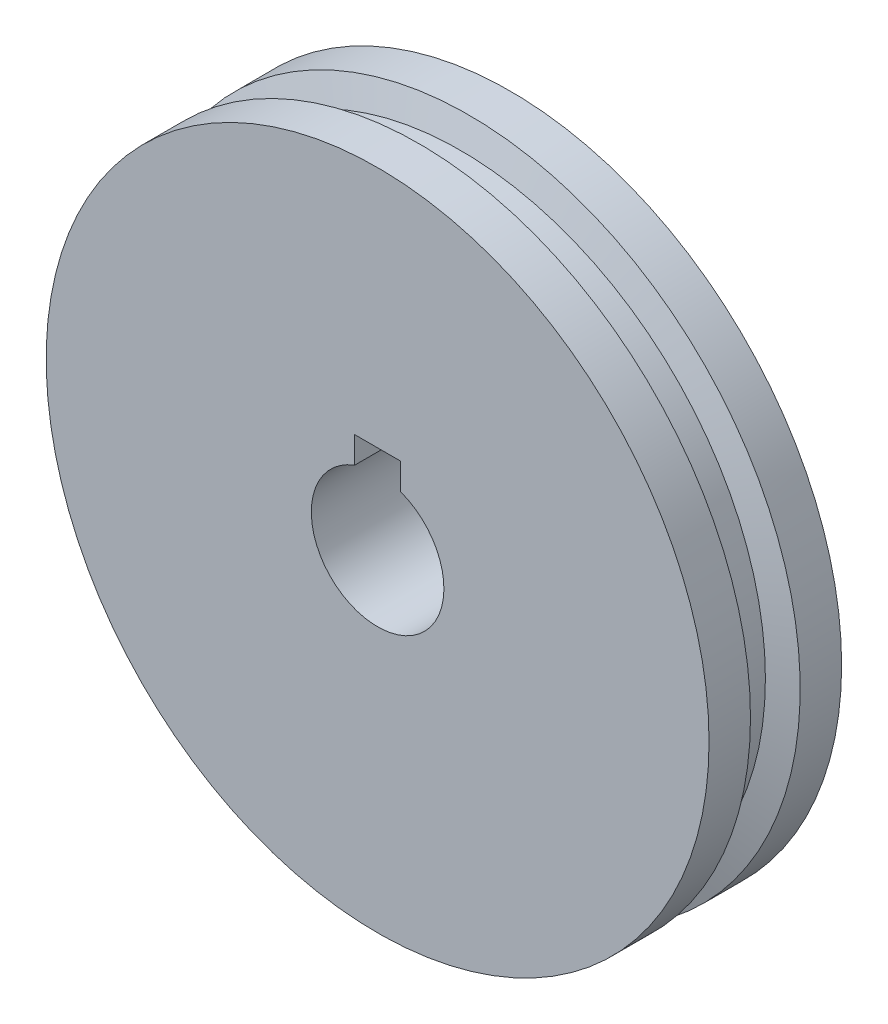
ISO-10303-21;
HEADER;
FILE_DESCRIPTION(('STEP AP214'),'2;1');
FILE_NAME('part.step','',(''),(''),'','','');
FILE_SCHEMA(('AUTOMOTIVE_DESIGN { 1 0 10303 214 1 1 1 1 }'));
ENDSEC;
DATA;
#1=APPLICATION_CONTEXT('core data for automotive mechanical design processes');
#2=APPLICATION_PROTOCOL_DEFINITION('international standard','automotive_design',2000,#1);
#3=PRODUCT_CONTEXT('',#1,'mechanical');
#4=PRODUCT('Part','Part','',(#3));
#5=PRODUCT_RELATED_PRODUCT_CATEGORY('part','',(#4));
#6=PRODUCT_DEFINITION_FORMATION('','',#4);
#7=PRODUCT_DEFINITION_CONTEXT('part definition',#1,'design');
#8=PRODUCT_DEFINITION('design','',#6,#7);
#9=PRODUCT_DEFINITION_SHAPE('','',#8);
#10=(LENGTH_UNIT() NAMED_UNIT(*) SI_UNIT(.MILLI.,.METRE.));
#11=(NAMED_UNIT(*) PLANE_ANGLE_UNIT() SI_UNIT($,.RADIAN.));
#12=(NAMED_UNIT(*) SI_UNIT($,.STERADIAN.) SOLID_ANGLE_UNIT());
#13=UNCERTAINTY_MEASURE_WITH_UNIT(LENGTH_MEASURE(1.E-05),#10,'distance_accuracy_value','');
#14=(GEOMETRIC_REPRESENTATION_CONTEXT(3) GLOBAL_UNCERTAINTY_ASSIGNED_CONTEXT((#13)) GLOBAL_UNIT_ASSIGNED_CONTEXT((#10,
#11,#12)) REPRESENTATION_CONTEXT('',''));
#15=CARTESIAN_POINT('',(0.,0.,0.));
#16=DIRECTION('',(0.,0.,1.));
#17=DIRECTION('',(1.,0.,0.));
#18=AXIS2_PLACEMENT_3D('',#15,#16,#17);
#19=CARTESIAN_POINT('',(0.,0.,5.));
#20=DIRECTION('',(0.,0.,-1.));
#21=DIRECTION('',(-1.,0.,0.));
#22=AXIS2_PLACEMENT_3D('',#19,#20,#21);
#23=CYLINDRICAL_SURFACE('',#22,25.);
#24=CARTESIAN_POINT('',(0.,0.,5.));
#25=DIRECTION('',(0.,0.,1.));
#26=DIRECTION('',(1.,0.,0.));
#27=AXIS2_PLACEMENT_3D('',#24,#25,#26);
#28=CIRCLE('',#27,25.);
#29=CARTESIAN_POINT('',(25.,0.,5.));
#30=VERTEX_POINT('',#29);
#31=EDGE_CURVE('E13',#30,#30,#28,.T.);
#32=ORIENTED_EDGE('',*,*,#31,.F.);
#33=EDGE_LOOP('',(#32));
#34=FACE_BOUND('',#33,.T.);
#35=CARTESIAN_POINT('',(0.,0.,1.875));
#36=DIRECTION('',(0.,0.,1.));
#37=DIRECTION('',(1.,0.,0.));
#38=AXIS2_PLACEMENT_3D('',#35,#36,#37);
#39=CIRCLE('',#38,25.);
#40=CARTESIAN_POINT('',(25.,0.,1.875));
#41=VERTEX_POINT('',#40);
#42=EDGE_CURVE('E49',#41,#41,#39,.F.);
#43=ORIENTED_EDGE('',*,*,#42,.F.);
#44=EDGE_LOOP('',(#43));
#45=FACE_BOUND('',#44,.T.);
#46=ADVANCED_FACE('F46',(#34,#45),#23,.T.);
#47=CARTESIAN_POINT('',(0.,0.,-5.));
#48=DIRECTION('',(0.,0.,1.));
#49=DIRECTION('',(1.,0.,0.));
#50=AXIS2_PLACEMENT_3D('',#47,#48,#49);
#51=CIRCLE('',#50,25.);
#52=CARTESIAN_POINT('',(25.,0.,-5.));
#53=VERTEX_POINT('',#52);
#54=EDGE_CURVE('E54',#53,#53,#51,.T.);
#55=ORIENTED_EDGE('',*,*,#54,.T.);
#56=EDGE_LOOP('',(#55));
#57=FACE_BOUND('',#56,.T.);
#58=CARTESIAN_POINT('',(0.,0.,-1.875));
#59=DIRECTION('',(0.,0.,-1.));
#60=DIRECTION('',(-1.,0.,0.));
#61=AXIS2_PLACEMENT_3D('',#58,#59,#60);
#62=CIRCLE('',#61,25.);
#63=CARTESIAN_POINT('',(-25.,0.,-1.875));
#64=VERTEX_POINT('',#63);
#65=EDGE_CURVE('E126',#64,#64,#62,.F.);
#66=ORIENTED_EDGE('',*,*,#65,.F.);
#67=EDGE_LOOP('',(#66));
#68=FACE_BOUND('',#67,.T.);
#69=ADVANCED_FACE('F142',(#57,#68),#23,.T.);
#70=CARTESIAN_POINT('',(0.,0.,5.));
#71=DIRECTION('',(0.,0.,1.));
#72=DIRECTION('',(1.,0.,0.));
#73=AXIS2_PLACEMENT_3D('',#70,#71,#72);
#74=PLANE('',#73);
#75=DIRECTION('',(0.,1.,0.));
#76=VECTOR('',#75,1.);
#77=CARTESIAN_POINT('',(-1.73287898578607,6.69010985165817,5.));
#78=LINE('',#77,#76);
#79=CARTESIAN_POINT('',(-1.73287898578607,4.69010985165817,5.));
#80=VERTEX_POINT('',#79);
#81=CARTESIAN_POINT('',(-1.73287898578607,6.69010985165817,5.));
#82=VERTEX_POINT('',#81);
#83=EDGE_CURVE('E71',#80,#82,#78,.T.);
#84=ORIENTED_EDGE('',*,*,#83,.T.);
#85=DIRECTION('',(1.,0.,0.));
#86=VECTOR('',#85,1.);
#87=CARTESIAN_POINT('',(1.73287898578607,6.69010985165817,5.));
#88=LINE('',#87,#86);
#89=CARTESIAN_POINT('',(1.73287898578607,6.69010985165817,5.));
#90=VERTEX_POINT('',#89);
#91=EDGE_CURVE('E96',#82,#90,#88,.T.);
#92=ORIENTED_EDGE('',*,*,#91,.T.);
#93=DIRECTION('',(0.,-1.,0.));
#94=VECTOR('',#93,1.);
#95=CARTESIAN_POINT('',(1.73287898578607,6.69010985165817,5.));
#96=LINE('',#95,#94);
#97=CARTESIAN_POINT('',(1.73287898578607,4.69010985165817,5.));
#98=VERTEX_POINT('',#97);
#99=EDGE_CURVE('E102',#90,#98,#96,.T.);
#100=ORIENTED_EDGE('',*,*,#99,.T.);
#101=CARTESIAN_POINT('',(0.,0.,5.));
#102=DIRECTION('',(0.,0.,1.));
#103=DIRECTION('',(1.,0.,0.));
#104=AXIS2_PLACEMENT_3D('',#101,#102,#103);
#105=CIRCLE('',#104,5.);
#106=EDGE_CURVE('E127',#80,#98,#105,.T.);
#107=ORIENTED_EDGE('',*,*,#106,.F.);
#108=EDGE_LOOP('',(#84,#92,#100,#107));
#109=FACE_BOUND('',#108,.T.);
#110=ORIENTED_EDGE('',*,*,#31,.T.);
#111=EDGE_LOOP('',(#110));
#112=FACE_BOUND('',#111,.T.);
#113=ADVANCED_FACE('F108',(#109,#112),#74,.T.);
#114=CARTESIAN_POINT('',(0.,0.,-5.));
#115=DIRECTION('',(0.,0.,1.));
#116=DIRECTION('',(1.,0.,0.));
#117=AXIS2_PLACEMENT_3D('',#114,#115,#116);
#118=PLANE('',#117);
#119=ORIENTED_EDGE('',*,*,#54,.F.);
#120=EDGE_LOOP('',(#119));
#121=FACE_BOUND('',#120,.T.);
#122=DIRECTION('',(1.,0.,0.));
#123=VECTOR('',#122,1.);
#124=CARTESIAN_POINT('',(1.73287898578607,6.69010985165817,-5.));
#125=LINE('',#124,#123);
#126=CARTESIAN_POINT('',(-1.73287898578607,6.69010985165817,-5.));
#127=VERTEX_POINT('',#126);
#128=CARTESIAN_POINT('',(1.73287898578607,6.69010985165817,-5.));
#129=VERTEX_POINT('',#128);
#130=EDGE_CURVE('E98',#127,#129,#125,.T.);
#131=ORIENTED_EDGE('',*,*,#130,.F.);
#132=DIRECTION('',(0.,1.,0.));
#133=VECTOR('',#132,1.);
#134=CARTESIAN_POINT('',(-1.73287898578607,6.69010985165817,-5.));
#135=LINE('',#134,#133);
#136=CARTESIAN_POINT('',(-1.73287898578607,4.69010985165817,-5.));
#137=VERTEX_POINT('',#136);
#138=EDGE_CURVE('E113',#137,#127,#135,.T.);
#139=ORIENTED_EDGE('',*,*,#138,.F.);
#140=CARTESIAN_POINT('',(0.,0.,-5.));
#141=DIRECTION('',(0.,0.,1.));
#142=DIRECTION('',(1.,0.,0.));
#143=AXIS2_PLACEMENT_3D('',#140,#141,#142);
#144=CIRCLE('',#143,5.);
#145=CARTESIAN_POINT('',(1.73287898578607,4.69010985165817,-5.));
#146=VERTEX_POINT('',#145);
#147=EDGE_CURVE('E129',#137,#146,#144,.T.);
#148=ORIENTED_EDGE('',*,*,#147,.T.);
#149=DIRECTION('',(0.,-1.,0.));
#150=VECTOR('',#149,1.);
#151=CARTESIAN_POINT('',(1.73287898578607,6.69010985165817,-5.));
#152=LINE('',#151,#150);
#153=EDGE_CURVE('E62',#129,#146,#152,.T.);
#154=ORIENTED_EDGE('',*,*,#153,.F.);
#155=EDGE_LOOP('',(#131,#139,#148,#154));
#156=FACE_BOUND('',#155,.T.);
#157=ADVANCED_FACE('F150',(#121,#156),#118,.F.);
#158=CARTESIAN_POINT('',(0.,0.,5.));
#159=DIRECTION('',(0.,0.,-1.));
#160=DIRECTION('',(-1.,0.,0.));
#161=AXIS2_PLACEMENT_3D('',#158,#159,#160);
#162=CYLINDRICAL_SURFACE('',#161,5.);
#163=DIRECTION('',(0.,0.,-1.));
#164=VECTOR('',#163,1.);
#165=CARTESIAN_POINT('',(-1.73287898578607,4.69010985165817,5.));
#166=LINE('',#165,#164);
#167=EDGE_CURVE('E84',#80,#137,#166,.T.);
#168=ORIENTED_EDGE('',*,*,#167,.F.);
#169=ORIENTED_EDGE('',*,*,#106,.T.);
#170=DIRECTION('',(0.,0.,-1.));
#171=VECTOR('',#170,1.);
#172=CARTESIAN_POINT('',(1.73287898578607,4.69010985165817,5.));
#173=LINE('',#172,#171);
#174=EDGE_CURVE('E99',#98,#146,#173,.T.);
#175=ORIENTED_EDGE('',*,*,#174,.T.);
#176=ORIENTED_EDGE('',*,*,#147,.F.);
#177=EDGE_LOOP('',(#168,#169,#175,#176));
#178=FACE_BOUND('',#177,.T.);
#179=ADVANCED_FACE('F155',(#178),#162,.F.);
#180=CARTESIAN_POINT('',(0.,0.,2.5));
#181=DIRECTION('',(0.,0.,1.));
#182=DIRECTION('',(1.,0.,0.));
#183=AXIS2_PLACEMENT_3D('',#180,#181,#182);
#184=CONICAL_SURFACE('',#183,27.,1.26791145841992);
#185=CARTESIAN_POINT('',(0.,0.,1.25));
#186=DIRECTION('',(0.,0.,1.));
#187=DIRECTION('',(1.,0.,0.));
#188=AXIS2_PLACEMENT_3D('',#185,#186,#187);
#189=CIRCLE('',#188,23.);
#190=CARTESIAN_POINT('',(23.,0.,1.25));
#191=VERTEX_POINT('',#190);
#192=EDGE_CURVE('E123',#191,#191,#189,.T.);
#193=ORIENTED_EDGE('',*,*,#192,.T.);
#194=EDGE_LOOP('',(#193));
#195=FACE_BOUND('',#194,.T.);
#196=ORIENTED_EDGE('',*,*,#42,.T.);
#197=EDGE_LOOP('',(#196));
#198=FACE_BOUND('',#197,.T.);
#199=ADVANCED_FACE('F139',(#195,#198),#184,.T.);
#200=CARTESIAN_POINT('',(0.,0.,-1.25));
#201=DIRECTION('',(0.,0.,-1.));
#202=DIRECTION('',(-1.,0.,0.));
#203=AXIS2_PLACEMENT_3D('',#200,#201,#202);
#204=CONICAL_SURFACE('',#203,23.,1.26791145841993);
#205=CARTESIAN_POINT('',(0.,0.,-1.25));
#206=DIRECTION('',(0.,0.,1.));
#207=DIRECTION('',(1.,0.,0.));
#208=AXIS2_PLACEMENT_3D('',#205,#206,#207);
#209=CIRCLE('',#208,23.);
#210=CARTESIAN_POINT('',(23.,0.,-1.25));
#211=VERTEX_POINT('',#210);
#212=EDGE_CURVE('E118',#211,#211,#209,.T.);
#213=ORIENTED_EDGE('',*,*,#212,.F.);
#214=EDGE_LOOP('',(#213));
#215=FACE_BOUND('',#214,.T.);
#216=ORIENTED_EDGE('',*,*,#65,.T.);
#217=EDGE_LOOP('',(#216));
#218=FACE_BOUND('',#217,.T.);
#219=ADVANCED_FACE('F163',(#215,#218),#204,.T.);
#220=CARTESIAN_POINT('',(0.,0.,14.237449016821));
#221=DIRECTION('',(0.,0.,1.));
#222=DIRECTION('',(1.,0.,0.));
#223=AXIS2_PLACEMENT_3D('',#220,#221,#222);
#224=CYLINDRICAL_SURFACE('',#223,23.);
#225=ORIENTED_EDGE('',*,*,#212,.T.);
#226=EDGE_LOOP('',(#225));
#227=FACE_BOUND('',#226,.T.);
#228=ORIENTED_EDGE('',*,*,#192,.F.);
#229=EDGE_LOOP('',(#228));
#230=FACE_BOUND('',#229,.T.);
#231=ADVANCED_FACE('F165',(#227,#230),#224,.T.);
#232=CARTESIAN_POINT('',(-1.73287898578607,6.69010985165817,5.));
#233=DIRECTION('',(-1.,0.,0.));
#234=DIRECTION('',(0.,0.,1.));
#235=AXIS2_PLACEMENT_3D('',#232,#233,#234);
#236=PLANE('',#235);
#237=ORIENTED_EDGE('',*,*,#138,.T.);
#238=DIRECTION('',(0.,0.,-1.));
#239=VECTOR('',#238,1.);
#240=CARTESIAN_POINT('',(-1.73287898578607,6.69010985165817,5.));
#241=LINE('',#240,#239);
#242=EDGE_CURVE('E87',#82,#127,#241,.T.);
#243=ORIENTED_EDGE('',*,*,#242,.F.);
#244=ORIENTED_EDGE('',*,*,#83,.F.);
#245=ORIENTED_EDGE('',*,*,#167,.T.);
#246=EDGE_LOOP('',(#237,#243,#244,#245));
#247=FACE_BOUND('',#246,.T.);
#248=ADVANCED_FACE('F168',(#247),#236,.F.);
#249=CARTESIAN_POINT('',(1.73287898578607,6.69010985165817,5.));
#250=DIRECTION('',(1.,0.,0.));
#251=DIRECTION('',(0.,0.,-1.));
#252=AXIS2_PLACEMENT_3D('',#249,#250,#251);
#253=PLANE('',#252);
#254=ORIENTED_EDGE('',*,*,#153,.T.);
#255=ORIENTED_EDGE('',*,*,#174,.F.);
#256=ORIENTED_EDGE('',*,*,#99,.F.);
#257=DIRECTION('',(0.,0.,-1.));
#258=VECTOR('',#257,1.);
#259=CARTESIAN_POINT('',(1.73287898578607,6.69010985165817,5.));
#260=LINE('',#259,#258);
#261=EDGE_CURVE('E92',#90,#129,#260,.T.);
#262=ORIENTED_EDGE('',*,*,#261,.T.);
#263=EDGE_LOOP('',(#254,#255,#256,#262));
#264=FACE_BOUND('',#263,.T.);
#265=ADVANCED_FACE('F103',(#264),#253,.F.);
#266=CARTESIAN_POINT('',(1.73287898578607,6.69010985165817,5.));
#267=DIRECTION('',(0.,1.,0.));
#268=DIRECTION('',(0.,0.,1.));
#269=AXIS2_PLACEMENT_3D('',#266,#267,#268);
#270=PLANE('',#269);
#271=ORIENTED_EDGE('',*,*,#130,.T.);
#272=ORIENTED_EDGE('',*,*,#261,.F.);
#273=ORIENTED_EDGE('',*,*,#91,.F.);
#274=ORIENTED_EDGE('',*,*,#242,.T.);
#275=EDGE_LOOP('',(#271,#272,#273,#274));
#276=FACE_BOUND('',#275,.T.);
#277=ADVANCED_FACE('F94',(#276),#270,.F.);
#278=CLOSED_SHELL('',(#46,#69,#113,#157,#179,#199,#219,#231,#248,#265,#277));
#279=MANIFOLD_SOLID_BREP('B2',#278);
#280=ADVANCED_BREP_SHAPE_REPRESENTATION('',(#18,#279),#14);
#281=SHAPE_DEFINITION_REPRESENTATION(#9,#280);
ENDSEC;
END-ISO-10303-21;
